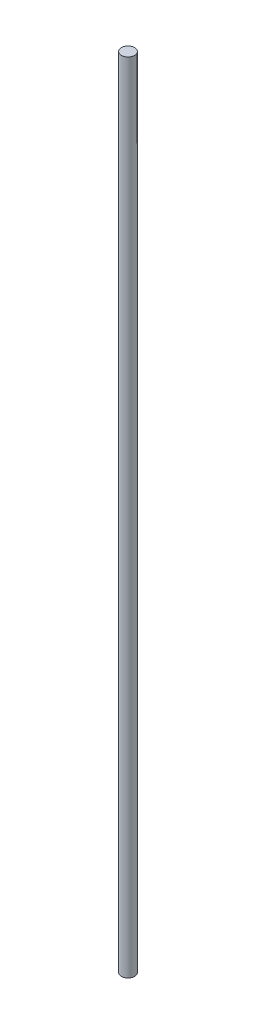
ISO-10303-21;
HEADER;
FILE_DESCRIPTION(('STEP AP214'),'2;1');
FILE_NAME('part.step','',(''),(''),'','','');
FILE_SCHEMA(('AUTOMOTIVE_DESIGN { 1 0 10303 214 1 1 1 1 }'));
ENDSEC;
DATA;
#1=APPLICATION_CONTEXT('core data for automotive mechanical design processes');
#2=APPLICATION_PROTOCOL_DEFINITION('international standard','automotive_design',2000,#1);
#3=PRODUCT_CONTEXT('',#1,'mechanical');
#4=PRODUCT('Part','Part','',(#3));
#5=PRODUCT_RELATED_PRODUCT_CATEGORY('part','',(#4));
#6=PRODUCT_DEFINITION_FORMATION('','',#4);
#7=PRODUCT_DEFINITION_CONTEXT('part definition',#1,'design');
#8=PRODUCT_DEFINITION('design','',#6,#7);
#9=PRODUCT_DEFINITION_SHAPE('','',#8);
#10=(LENGTH_UNIT() NAMED_UNIT(*) SI_UNIT(.MILLI.,.METRE.));
#11=(NAMED_UNIT(*) PLANE_ANGLE_UNIT() SI_UNIT($,.RADIAN.));
#12=(NAMED_UNIT(*) SI_UNIT($,.STERADIAN.) SOLID_ANGLE_UNIT());
#13=UNCERTAINTY_MEASURE_WITH_UNIT(LENGTH_MEASURE(1.E-05),#10,'distance_accuracy_value','');
#14=(GEOMETRIC_REPRESENTATION_CONTEXT(3) GLOBAL_UNCERTAINTY_ASSIGNED_CONTEXT((#13)) GLOBAL_UNIT_ASSIGNED_CONTEXT((#10,
#11,#12)) REPRESENTATION_CONTEXT('',''));
#15=CARTESIAN_POINT('',(0.,0.,0.));
#16=DIRECTION('',(0.,0.,1.));
#17=DIRECTION('',(1.,0.,0.));
#18=AXIS2_PLACEMENT_3D('',#15,#16,#17);
#19=CARTESIAN_POINT('',(0.,475.,0.));
#20=DIRECTION('',(0.,-1.,0.));
#21=DIRECTION('',(0.,0.,-1.));
#22=AXIS2_PLACEMENT_3D('',#19,#20,#21);
#23=CYLINDRICAL_SURFACE('',#22,4.);
#24=CARTESIAN_POINT('',(0.,475.,0.));
#25=DIRECTION('',(0.,1.,0.));
#26=DIRECTION('',(0.,0.,1.));
#27=AXIS2_PLACEMENT_3D('',#24,#25,#26);
#28=CIRCLE('',#27,4.);
#29=CARTESIAN_POINT('',(0.,475.,4.));
#30=VERTEX_POINT('',#29);
#31=EDGE_CURVE('E10',#30,#30,#28,.T.);
#32=ORIENTED_EDGE('',*,*,#31,.F.);
#33=EDGE_LOOP('',(#32));
#34=FACE_BOUND('',#33,.T.);
#35=CARTESIAN_POINT('',(0.,0.,0.));
#36=DIRECTION('',(0.,1.,0.));
#37=DIRECTION('',(0.,0.,1.));
#38=AXIS2_PLACEMENT_3D('',#35,#36,#37);
#39=CIRCLE('',#38,4.);
#40=CARTESIAN_POINT('',(0.,0.,4.));
#41=VERTEX_POINT('',#40);
#42=EDGE_CURVE('E31',#41,#41,#39,.T.);
#43=ORIENTED_EDGE('',*,*,#42,.T.);
#44=EDGE_LOOP('',(#43));
#45=FACE_BOUND('',#44,.T.);
#46=ADVANCED_FACE('F28',(#34,#45),#23,.T.);
#47=CARTESIAN_POINT('',(0.,475.,0.));
#48=DIRECTION('',(0.,1.,0.));
#49=DIRECTION('',(0.,0.,1.));
#50=AXIS2_PLACEMENT_3D('',#47,#48,#49);
#51=PLANE('',#50);
#52=ORIENTED_EDGE('',*,*,#31,.T.);
#53=EDGE_LOOP('',(#52));
#54=FACE_BOUND('',#53,.T.);
#55=ADVANCED_FACE('F43',(#54),#51,.T.);
#56=CARTESIAN_POINT('',(0.,0.,0.));
#57=DIRECTION('',(0.,1.,0.));
#58=DIRECTION('',(0.,0.,1.));
#59=AXIS2_PLACEMENT_3D('',#56,#57,#58);
#60=PLANE('',#59);
#61=ORIENTED_EDGE('',*,*,#42,.F.);
#62=EDGE_LOOP('',(#61));
#63=FACE_BOUND('',#62,.T.);
#64=ADVANCED_FACE('F41',(#63),#60,.F.);
#65=CLOSED_SHELL('',(#46,#55,#64));
#66=MANIFOLD_SOLID_BREP('B2',#65);
#67=ADVANCED_BREP_SHAPE_REPRESENTATION('',(#18,#66),#14);
#68=SHAPE_DEFINITION_REPRESENTATION(#9,#67);
ENDSEC;
END-ISO-10303-21;
